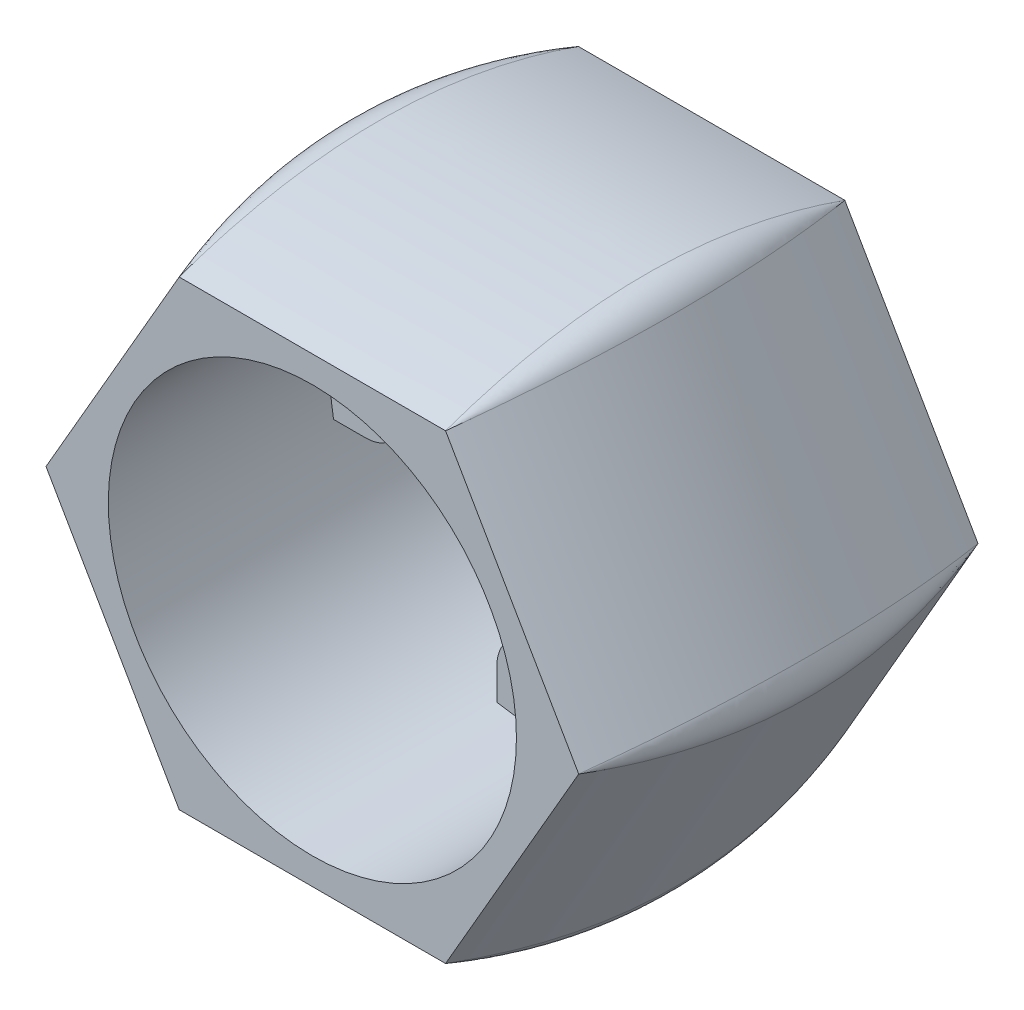
ISO-10303-21;
HEADER;
FILE_DESCRIPTION(('STEP AP214'),'2;1');
FILE_NAME('part.step','',(''),(''),'','','');
FILE_SCHEMA(('AUTOMOTIVE_DESIGN { 1 0 10303 214 1 1 1 1 }'));
ENDSEC;
DATA;
#1=APPLICATION_CONTEXT('core data for automotive mechanical design processes');
#2=APPLICATION_PROTOCOL_DEFINITION('international standard','automotive_design',2000,#1);
#3=PRODUCT_CONTEXT('',#1,'mechanical');
#4=PRODUCT('Part','Part','',(#3));
#5=PRODUCT_RELATED_PRODUCT_CATEGORY('part','',(#4));
#6=PRODUCT_DEFINITION_FORMATION('','',#4);
#7=PRODUCT_DEFINITION_CONTEXT('part definition',#1,'design');
#8=PRODUCT_DEFINITION('design','',#6,#7);
#9=PRODUCT_DEFINITION_SHAPE('','',#8);
#10=(LENGTH_UNIT() NAMED_UNIT(*) SI_UNIT(.MILLI.,.METRE.));
#11=(NAMED_UNIT(*) PLANE_ANGLE_UNIT() SI_UNIT($,.RADIAN.));
#12=(NAMED_UNIT(*) SI_UNIT($,.STERADIAN.) SOLID_ANGLE_UNIT());
#13=UNCERTAINTY_MEASURE_WITH_UNIT(LENGTH_MEASURE(1.E-05),#10,'distance_accuracy_value','');
#14=(GEOMETRIC_REPRESENTATION_CONTEXT(3) GLOBAL_UNCERTAINTY_ASSIGNED_CONTEXT((#13)) GLOBAL_UNIT_ASSIGNED_CONTEXT((#10,
#11,#12)) REPRESENTATION_CONTEXT('',''));
#15=CARTESIAN_POINT('',(0.,0.,0.));
#16=DIRECTION('',(0.,0.,1.));
#17=DIRECTION('',(1.,0.,0.));
#18=AXIS2_PLACEMENT_3D('',#15,#16,#17);
#19=CARTESIAN_POINT('',(0.,0.,45.));
#20=DIRECTION('',(0.,0.,-1.));
#21=DIRECTION('',(-1.,0.,0.));
#22=AXIS2_PLACEMENT_3D('',#19,#20,#21);
#23=CYLINDRICAL_SURFACE('',#22,23.);
#24=DIRECTION('',(0.,0.,-1.));
#25=VECTOR('',#24,1.);
#26=CARTESIAN_POINT('',(22.6132704401641,4.2,20.));
#27=LINE('',#26,#25);
#28=CARTESIAN_POINT('',(22.6132704401641,4.2,20.));
#29=VERTEX_POINT('',#28);
#30=CARTESIAN_POINT('',(22.6132704401641,4.2,0.));
#31=VERTEX_POINT('',#30);
#32=EDGE_CURVE('E401',#29,#31,#27,.T.);
#33=ORIENTED_EDGE('',*,*,#32,.F.);
#34=CARTESIAN_POINT('',(0.,0.,20.));
#35=DIRECTION('',(0.,0.,1.));
#36=DIRECTION('',(1.,0.,0.));
#37=AXIS2_PLACEMENT_3D('',#34,#35,#36);
#38=CIRCLE('',#37,23.);
#39=CARTESIAN_POINT('',(22.6132704401641,-4.2,20.));
#40=VERTEX_POINT('',#39);
#41=EDGE_CURVE('E398',#40,#29,#38,.T.);
#42=ORIENTED_EDGE('',*,*,#41,.F.);
#43=DIRECTION('',(0.,0.,-1.));
#44=VECTOR('',#43,1.);
#45=CARTESIAN_POINT('',(22.6132704401641,-4.2,20.));
#46=LINE('',#45,#44);
#47=CARTESIAN_POINT('',(22.6132704401641,-4.2,0.));
#48=VERTEX_POINT('',#47);
#49=EDGE_CURVE('E419',#40,#48,#46,.T.);
#50=ORIENTED_EDGE('',*,*,#49,.T.);
#51=CARTESIAN_POINT('',(0.,0.,0.));
#52=DIRECTION('',(0.,0.,1.));
#53=DIRECTION('',(1.,0.,0.));
#54=AXIS2_PLACEMENT_3D('',#51,#52,#53);
#55=CIRCLE('',#54,23.);
#56=CARTESIAN_POINT('',(4.2,-22.6132704401641,0.));
#57=VERTEX_POINT('',#56);
#58=EDGE_CURVE('E430',#57,#48,#55,.T.);
#59=ORIENTED_EDGE('',*,*,#58,.F.);
#60=DIRECTION('',(0.,0.,-1.));
#61=VECTOR('',#60,1.);
#62=CARTESIAN_POINT('',(4.2,-22.6132704401641,20.));
#63=LINE('',#62,#61);
#64=CARTESIAN_POINT('',(4.2,-22.6132704401641,20.));
#65=VERTEX_POINT('',#64);
#66=EDGE_CURVE('E450',#65,#57,#63,.T.);
#67=ORIENTED_EDGE('',*,*,#66,.F.);
#68=CARTESIAN_POINT('',(0.,0.,20.));
#69=DIRECTION('',(0.,0.,1.));
#70=DIRECTION('',(1.,0.,0.));
#71=AXIS2_PLACEMENT_3D('',#68,#69,#70);
#72=CIRCLE('',#71,23.);
#73=CARTESIAN_POINT('',(-4.2,-22.6132704401641,20.));
#74=VERTEX_POINT('',#73);
#75=EDGE_CURVE('E447',#74,#65,#72,.T.);
#76=ORIENTED_EDGE('',*,*,#75,.F.);
#77=DIRECTION('',(0.,0.,-1.));
#78=VECTOR('',#77,1.);
#79=CARTESIAN_POINT('',(-4.2,-22.6132704401641,20.));
#80=LINE('',#79,#78);
#81=CARTESIAN_POINT('',(-4.2,-22.6132704401641,0.));
#82=VERTEX_POINT('',#81);
#83=EDGE_CURVE('E466',#74,#82,#80,.T.);
#84=ORIENTED_EDGE('',*,*,#83,.T.);
#85=CARTESIAN_POINT('',(-22.6132704401641,-4.2,0.));
#86=VERTEX_POINT('',#85);
#87=EDGE_CURVE('E616',#86,#82,#55,.T.);
#88=ORIENTED_EDGE('',*,*,#87,.F.);
#89=DIRECTION('',(0.,0.,-1.));
#90=VECTOR('',#89,1.);
#91=CARTESIAN_POINT('',(-22.6132704401641,-4.2,20.));
#92=LINE('',#91,#90);
#93=CARTESIAN_POINT('',(-22.6132704401641,-4.2,20.));
#94=VERTEX_POINT('',#93);
#95=EDGE_CURVE('E495',#94,#86,#92,.T.);
#96=ORIENTED_EDGE('',*,*,#95,.F.);
#97=CARTESIAN_POINT('',(0.,0.,20.));
#98=DIRECTION('',(0.,0.,1.));
#99=DIRECTION('',(1.,0.,0.));
#100=AXIS2_PLACEMENT_3D('',#97,#98,#99);
#101=CIRCLE('',#100,23.);
#102=CARTESIAN_POINT('',(-22.6132704401641,4.2,20.));
#103=VERTEX_POINT('',#102);
#104=EDGE_CURVE('E492',#103,#94,#101,.T.);
#105=ORIENTED_EDGE('',*,*,#104,.F.);
#106=DIRECTION('',(0.,0.,-1.));
#107=VECTOR('',#106,1.);
#108=CARTESIAN_POINT('',(-22.6132704401641,4.2,20.));
#109=LINE('',#108,#107);
#110=CARTESIAN_POINT('',(-22.6132704401641,4.2,0.));
#111=VERTEX_POINT('',#110);
#112=EDGE_CURVE('E511',#103,#111,#109,.T.);
#113=ORIENTED_EDGE('',*,*,#112,.T.);
#114=CARTESIAN_POINT('',(-4.2,22.6132704401641,0.));
#115=VERTEX_POINT('',#114);
#116=EDGE_CURVE('E587',#115,#111,#55,.T.);
#117=ORIENTED_EDGE('',*,*,#116,.F.);
#118=DIRECTION('',(0.,0.,-1.));
#119=VECTOR('',#118,1.);
#120=CARTESIAN_POINT('',(-4.2,22.6132704401641,20.));
#121=LINE('',#120,#119);
#122=CARTESIAN_POINT('',(-4.2,22.6132704401641,20.));
#123=VERTEX_POINT('',#122);
#124=EDGE_CURVE('E540',#123,#115,#121,.T.);
#125=ORIENTED_EDGE('',*,*,#124,.F.);
#126=CARTESIAN_POINT('',(0.,0.,20.));
#127=DIRECTION('',(0.,0.,1.));
#128=DIRECTION('',(1.,0.,0.));
#129=AXIS2_PLACEMENT_3D('',#126,#127,#128);
#130=CIRCLE('',#129,23.);
#131=CARTESIAN_POINT('',(4.2,22.6132704401641,20.));
#132=VERTEX_POINT('',#131);
#133=EDGE_CURVE('E537',#132,#123,#130,.T.);
#134=ORIENTED_EDGE('',*,*,#133,.F.);
#135=DIRECTION('',(0.,0.,-1.));
#136=VECTOR('',#135,1.);
#137=CARTESIAN_POINT('',(4.2,22.6132704401641,20.));
#138=LINE('',#137,#136);
#139=CARTESIAN_POINT('',(4.2,22.6132704401641,0.));
#140=VERTEX_POINT('',#139);
#141=EDGE_CURVE('E556',#132,#140,#138,.T.);
#142=ORIENTED_EDGE('',*,*,#141,.T.);
#143=EDGE_CURVE('E220',#31,#140,#55,.T.);
#144=ORIENTED_EDGE('',*,*,#143,.F.);
#145=EDGE_LOOP('',(#33,#42,#50,#59,#67,#76,#84,#88,#96,#105,#113,#117,#125,#134,#142,#144));
#146=FACE_BOUND('',#145,.T.);
#147=CARTESIAN_POINT('',(0.,0.,45.));
#148=DIRECTION('',(0.,0.,1.));
#149=DIRECTION('',(1.,0.,0.));
#150=AXIS2_PLACEMENT_3D('',#147,#148,#149);
#151=CIRCLE('',#150,23.);
#152=CARTESIAN_POINT('',(23.,0.,45.));
#153=VERTEX_POINT('',#152);
#154=EDGE_CURVE('E566',#153,#153,#151,.T.);
#155=ORIENTED_EDGE('',*,*,#154,.T.);
#156=EDGE_LOOP('',(#155));
#157=FACE_BOUND('',#156,.T.);
#158=ADVANCED_FACE('F51',(#146,#157),#23,.F.);
#159=CARTESIAN_POINT('',(0.,0.,45.));
#160=DIRECTION('',(0.,0.,1.));
#161=DIRECTION('',(1.,0.,0.));
#162=AXIS2_PLACEMENT_3D('',#159,#160,#161);
#163=PLANE('',#162);
#164=ORIENTED_EDGE('',*,*,#154,.F.);
#165=EDGE_LOOP('',(#164));
#166=FACE_BOUND('',#165,.T.);
#167=DIRECTION('',(-1.,0.,0.));
#168=VECTOR('',#167,1.);
#169=CARTESIAN_POINT('',(0.,26.,45.));
#170=LINE('',#169,#168);
#171=CARTESIAN_POINT('',(15.0111069989983,25.999999999882,45.));
#172=VERTEX_POINT('',#171);
#173=CARTESIAN_POINT('',(-15.0111069989303,26.,45.));
#174=VERTEX_POINT('',#173);
#175=EDGE_CURVE('E570',#172,#174,#170,.T.);
#176=ORIENTED_EDGE('',*,*,#175,.T.);
#177=DIRECTION('',(-0.499999999999997,-0.86602540378444,0.));
#178=VECTOR('',#177,1.);
#179=CARTESIAN_POINT('',(-22.5166604983954,12.9999999999999,45.));
#180=LINE('',#179,#178);
#181=CARTESIAN_POINT('',(-30.0222139976753,-1.07046316255577E-10,45.0000000006048));
#182=VERTEX_POINT('',#181);
#183=EDGE_CURVE('E229',#174,#182,#180,.T.);
#184=ORIENTED_EDGE('',*,*,#183,.T.);
#185=DIRECTION('',(0.500000000000003,-0.866025403784437,0.));
#186=VECTOR('',#185,1.);
#187=CARTESIAN_POINT('',(-22.5166604983954,-13.0000000000001,45.));
#188=LINE('',#187,#186);
#189=CARTESIAN_POINT('',(-15.0111069987568,-26.0000000000651,45.0000000000305));
#190=VERTEX_POINT('',#189);
#191=EDGE_CURVE('E575',#182,#190,#188,.T.);
#192=ORIENTED_EDGE('',*,*,#191,.T.);
#193=DIRECTION('',(1.,0.,0.));
#194=VECTOR('',#193,1.);
#195=CARTESIAN_POINT('',(0.,-26.,45.));
#196=LINE('',#195,#194);
#197=CARTESIAN_POINT('',(15.0111069989304,-26.,45.));
#198=VERTEX_POINT('',#197);
#199=EDGE_CURVE('E579',#190,#198,#196,.T.);
#200=ORIENTED_EDGE('',*,*,#199,.T.);
#201=DIRECTION('',(0.499999999999997,0.86602540378444,0.));
#202=VECTOR('',#201,1.);
#203=CARTESIAN_POINT('',(22.5166604983954,-12.9999999999999,45.));
#204=LINE('',#203,#202);
#205=CARTESIAN_POINT('',(30.0222139976435,6.26686202931381E-11,45.0000000006034));
#206=VERTEX_POINT('',#205);
#207=EDGE_CURVE('E60',#198,#206,#204,.T.);
#208=ORIENTED_EDGE('',*,*,#207,.T.);
#209=DIRECTION('',(-0.500000000000003,0.866025403784437,0.));
#210=VECTOR('',#209,1.);
#211=CARTESIAN_POINT('',(22.5166604983954,13.0000000000001,45.));
#212=LINE('',#211,#210);
#213=EDGE_CURVE('E11',#206,#172,#212,.T.);
#214=ORIENTED_EDGE('',*,*,#213,.T.);
#215=EDGE_LOOP('',(#176,#184,#192,#200,#208,#214));
#216=FACE_BOUND('',#215,.T.);
#217=ADVANCED_FACE('F605',(#166,#216),#163,.T.);
#218=CARTESIAN_POINT('',(0.,0.,0.));
#219=DIRECTION('',(0.,0.,1.));
#220=DIRECTION('',(1.,0.,0.));
#221=AXIS2_PLACEMENT_3D('',#218,#219,#220);
#222=PLANE('',#221);
#223=ORIENTED_EDGE('',*,*,#143,.T.);
#224=DIRECTION('',(0.,1.,0.));
#225=VECTOR('',#224,1.);
#226=CARTESIAN_POINT('',(4.2,0.,0.));
#227=LINE('',#226,#225);
#228=CARTESIAN_POINT('',(4.2,19.,0.));
#229=VERTEX_POINT('',#228);
#230=EDGE_CURVE('E526',#229,#140,#227,.T.);
#231=ORIENTED_EDGE('',*,*,#230,.F.);
#232=CARTESIAN_POINT('',(0.,19.,0.));
#233=DIRECTION('',(0.,0.,1.));
#234=DIRECTION('',(1.,0.,0.));
#235=AXIS2_PLACEMENT_3D('',#232,#233,#234);
#236=CIRCLE('',#235,4.2);
#237=CARTESIAN_POINT('',(-4.2,19.,0.));
#238=VERTEX_POINT('',#237);
#239=EDGE_CURVE('E547',#238,#229,#236,.T.);
#240=ORIENTED_EDGE('',*,*,#239,.F.);
#241=DIRECTION('',(0.,1.,0.));
#242=VECTOR('',#241,1.);
#243=CARTESIAN_POINT('',(-4.2,0.,0.));
#244=LINE('',#243,#242);
#245=EDGE_CURVE('E544',#238,#115,#244,.T.);
#246=ORIENTED_EDGE('',*,*,#245,.T.);
#247=ORIENTED_EDGE('',*,*,#116,.T.);
#248=DIRECTION('',(-1.,0.,0.));
#249=VECTOR('',#248,1.);
#250=CARTESIAN_POINT('',(0.,4.19999999999998,0.));
#251=LINE('',#250,#249);
#252=CARTESIAN_POINT('',(-19.,4.2,0.));
#253=VERTEX_POINT('',#252);
#254=EDGE_CURVE('E481',#253,#111,#251,.T.);
#255=ORIENTED_EDGE('',*,*,#254,.F.);
#256=CARTESIAN_POINT('',(-19.,0.,0.));
#257=DIRECTION('',(0.,0.,1.));
#258=DIRECTION('',(1.,0.,0.));
#259=AXIS2_PLACEMENT_3D('',#256,#257,#258);
#260=CIRCLE('',#259,4.2);
#261=CARTESIAN_POINT('',(-19.,-4.2,0.));
#262=VERTEX_POINT('',#261);
#263=EDGE_CURVE('E503',#262,#253,#260,.T.);
#264=ORIENTED_EDGE('',*,*,#263,.F.);
#265=DIRECTION('',(-1.,0.,0.));
#266=VECTOR('',#265,1.);
#267=CARTESIAN_POINT('',(0.,-4.20000000000002,0.));
#268=LINE('',#267,#266);
#269=EDGE_CURVE('E75',#262,#86,#268,.T.);
#270=ORIENTED_EDGE('',*,*,#269,.T.);
#271=ORIENTED_EDGE('',*,*,#87,.T.);
#272=DIRECTION('',(0.,-1.,0.));
#273=VECTOR('',#272,1.);
#274=CARTESIAN_POINT('',(-4.2,0.,0.));
#275=LINE('',#274,#273);
#276=CARTESIAN_POINT('',(-4.2,-19.,0.));
#277=VERTEX_POINT('',#276);
#278=EDGE_CURVE('E436',#277,#82,#275,.T.);
#279=ORIENTED_EDGE('',*,*,#278,.F.);
#280=CARTESIAN_POINT('',(0.,-19.,0.));
#281=DIRECTION('',(0.,0.,1.));
#282=DIRECTION('',(1.,0.,0.));
#283=AXIS2_PLACEMENT_3D('',#280,#281,#282);
#284=CIRCLE('',#283,4.2);
#285=CARTESIAN_POINT('',(4.2,-19.,0.));
#286=VERTEX_POINT('',#285);
#287=EDGE_CURVE('E458',#286,#277,#284,.T.);
#288=ORIENTED_EDGE('',*,*,#287,.F.);
#289=DIRECTION('',(0.,-1.,0.));
#290=VECTOR('',#289,1.);
#291=CARTESIAN_POINT('',(4.20000000000001,0.,0.));
#292=LINE('',#291,#290);
#293=EDGE_CURVE('E68',#286,#57,#292,.T.);
#294=ORIENTED_EDGE('',*,*,#293,.T.);
#295=ORIENTED_EDGE('',*,*,#58,.T.);
#296=DIRECTION('',(1.,0.,0.));
#297=VECTOR('',#296,1.);
#298=CARTESIAN_POINT('',(0.,-4.2,0.));
#299=LINE('',#298,#297);
#300=CARTESIAN_POINT('',(19.,-4.2,0.));
#301=VERTEX_POINT('',#300);
#302=EDGE_CURVE('E387',#301,#48,#299,.T.);
#303=ORIENTED_EDGE('',*,*,#302,.F.);
#304=CARTESIAN_POINT('',(19.,0.,0.));
#305=DIRECTION('',(0.,0.,1.));
#306=DIRECTION('',(1.,0.,0.));
#307=AXIS2_PLACEMENT_3D('',#304,#305,#306);
#308=CIRCLE('',#307,4.2);
#309=CARTESIAN_POINT('',(19.,4.2,0.));
#310=VERTEX_POINT('',#309);
#311=EDGE_CURVE('E410',#310,#301,#308,.T.);
#312=ORIENTED_EDGE('',*,*,#311,.F.);
#313=DIRECTION('',(1.,0.,0.));
#314=VECTOR('',#313,1.);
#315=CARTESIAN_POINT('',(0.,4.19999999999999,0.));
#316=LINE('',#315,#314);
#317=EDGE_CURVE('E406',#310,#31,#316,.T.);
#318=ORIENTED_EDGE('',*,*,#317,.T.);
#319=EDGE_LOOP('',(#223,#231,#240,#246,#247,#255,#264,#270,#271,#279,#288,#294,#295,#303,#312,#318));
#320=FACE_BOUND('',#319,.T.);
#321=DIRECTION('',(-1.,0.,0.));
#322=VECTOR('',#321,1.);
#323=CARTESIAN_POINT('',(0.,26.,0.));
#324=LINE('',#323,#322);
#325=CARTESIAN_POINT('',(15.0111069989931,26.0000000000001,0.));
#326=VERTEX_POINT('',#325);
#327=CARTESIAN_POINT('',(-15.0111069989645,26.,-1.59124867323539E-10));
#328=VERTEX_POINT('',#327);
#329=EDGE_CURVE('E206',#326,#328,#324,.T.);
#330=ORIENTED_EDGE('',*,*,#329,.F.);
#331=DIRECTION('',(-0.500000000000003,0.866025403784437,0.));
#332=VECTOR('',#331,1.);
#333=CARTESIAN_POINT('',(22.5166604983954,13.0000000000001,0.));
#334=LINE('',#333,#332);
#335=CARTESIAN_POINT('',(30.0222139976915,2.92899385301427E-10,-9.23328376386431E-11));
#336=VERTEX_POINT('',#335);
#337=EDGE_CURVE('E54',#336,#326,#334,.T.);
#338=ORIENTED_EDGE('',*,*,#337,.F.);
#339=DIRECTION('',(0.499999999999997,0.86602540378444,0.));
#340=VECTOR('',#339,1.);
#341=CARTESIAN_POINT('',(22.5166604983954,-12.9999999999999,0.));
#342=LINE('',#341,#340);
#343=CARTESIAN_POINT('',(15.0111069992849,-25.9999999999521,-4.52970994047064E-11));
#344=VERTEX_POINT('',#343);
#345=EDGE_CURVE('E594',#344,#336,#342,.T.);
#346=ORIENTED_EDGE('',*,*,#345,.F.);
#347=DIRECTION('',(1.,0.,0.));
#348=VECTOR('',#347,1.);
#349=CARTESIAN_POINT('',(0.,-26.,0.));
#350=LINE('',#349,#348);
#351=CARTESIAN_POINT('',(-15.0111069987067,-26.0000000001087,-2.04281036531029E-11));
#352=VERTEX_POINT('',#351);
#353=EDGE_CURVE('E591',#352,#344,#350,.T.);
#354=ORIENTED_EDGE('',*,*,#353,.F.);
#355=DIRECTION('',(0.500000000000003,-0.866025403784437,0.));
#356=VECTOR('',#355,1.);
#357=CARTESIAN_POINT('',(-22.5166604983954,-13.0000000000001,0.));
#358=LINE('',#357,#356);
#359=CARTESIAN_POINT('',(-30.0222139975279,-1.20979615214623E-11,-5.64071966251785E-10));
#360=VERTEX_POINT('',#359);
#361=EDGE_CURVE('E238',#360,#352,#358,.T.);
#362=ORIENTED_EDGE('',*,*,#361,.F.);
#363=DIRECTION('',(-0.499999999999997,-0.86602540378444,0.));
#364=VECTOR('',#363,1.);
#365=CARTESIAN_POINT('',(-22.5166604983954,12.9999999999999,0.));
#366=LINE('',#365,#364);
#367=EDGE_CURVE('E219',#328,#360,#366,.T.);
#368=ORIENTED_EDGE('',*,*,#367,.F.);
#369=EDGE_LOOP('',(#330,#338,#346,#354,#362,#368));
#370=FACE_BOUND('',#369,.T.);
#371=CARTESIAN_POINT('',(0.,19.,0.));
#372=DIRECTION('',(0.,0.,1.));
#373=DIRECTION('',(1.,0.,0.));
#374=AXIS2_PLACEMENT_3D('',#371,#372,#373);
#375=CIRCLE('',#374,1.7);
#376=CARTESIAN_POINT('',(1.7,19.,0.));
#377=VERTEX_POINT('',#376);
#378=EDGE_CURVE('E372',#377,#377,#375,.T.);
#379=ORIENTED_EDGE('',*,*,#378,.T.);
#380=EDGE_LOOP('',(#379));
#381=FACE_BOUND('',#380,.T.);
#382=CARTESIAN_POINT('',(-19.,0.,0.));
#383=DIRECTION('',(0.,0.,1.));
#384=DIRECTION('',(1.,0.,0.));
#385=AXIS2_PLACEMENT_3D('',#382,#383,#384);
#386=CIRCLE('',#385,1.7);
#387=CARTESIAN_POINT('',(-17.3,0.,0.));
#388=VERTEX_POINT('',#387);
#389=EDGE_CURVE('E496',#388,#388,#386,.T.);
#390=ORIENTED_EDGE('',*,*,#389,.T.);
#391=EDGE_LOOP('',(#390));
#392=FACE_BOUND('',#391,.T.);
#393=CARTESIAN_POINT('',(0.,-19.,0.));
#394=DIRECTION('',(0.,0.,1.));
#395=DIRECTION('',(1.,0.,0.));
#396=AXIS2_PLACEMENT_3D('',#393,#394,#395);
#397=CIRCLE('',#396,1.7);
#398=CARTESIAN_POINT('',(1.7,-19.,0.));
#399=VERTEX_POINT('',#398);
#400=EDGE_CURVE('E451',#399,#399,#397,.T.);
#401=ORIENTED_EDGE('',*,*,#400,.T.);
#402=EDGE_LOOP('',(#401));
#403=FACE_BOUND('',#402,.T.);
#404=CARTESIAN_POINT('',(19.,0.,0.));
#405=DIRECTION('',(0.,0.,1.));
#406=DIRECTION('',(1.,0.,0.));
#407=AXIS2_PLACEMENT_3D('',#404,#405,#406);
#408=CIRCLE('',#407,1.7);
#409=CARTESIAN_POINT('',(20.7,0.,0.));
#410=VERTEX_POINT('',#409);
#411=EDGE_CURVE('E402',#410,#410,#408,.T.);
#412=ORIENTED_EDGE('',*,*,#411,.T.);
#413=EDGE_LOOP('',(#412));
#414=FACE_BOUND('',#413,.T.);
#415=ADVANCED_FACE('F235',(#320,#370,#381,#392,#403,#414),#222,.F.);
#416=CARTESIAN_POINT('',(-4.2,0.,20.));
#417=DIRECTION('',(-1.,0.,0.));
#418=DIRECTION('',(0.,-1.,0.));
#419=AXIS2_PLACEMENT_3D('',#416,#417,#418);
#420=PLANE('',#419);
#421=ORIENTED_EDGE('',*,*,#245,.F.);
#422=DIRECTION('',(0.,0.,-1.));
#423=VECTOR('',#422,1.);
#424=CARTESIAN_POINT('',(-4.2,19.,20.));
#425=LINE('',#424,#423);
#426=CARTESIAN_POINT('',(-4.2,19.,20.));
#427=VERTEX_POINT('',#426);
#428=EDGE_CURVE('E500',#427,#238,#425,.T.);
#429=ORIENTED_EDGE('',*,*,#428,.F.);
#430=DIRECTION('',(0.,1.,0.));
#431=VECTOR('',#430,1.);
#432=CARTESIAN_POINT('',(-4.2,0.,20.));
#433=LINE('',#432,#431);
#434=EDGE_CURVE('E525',#427,#123,#433,.T.);
#435=ORIENTED_EDGE('',*,*,#434,.T.);
#436=ORIENTED_EDGE('',*,*,#124,.T.);
#437=EDGE_LOOP('',(#421,#429,#435,#436));
#438=FACE_BOUND('',#437,.T.);
#439=ADVANCED_FACE('F675',(#438),#420,.T.);
#440=CARTESIAN_POINT('',(0.,19.,20.));
#441=DIRECTION('',(0.,0.,-1.));
#442=DIRECTION('',(-1.,0.,0.));
#443=AXIS2_PLACEMENT_3D('',#440,#441,#442);
#444=CYLINDRICAL_SURFACE('',#443,4.2);
#445=ORIENTED_EDGE('',*,*,#239,.T.);
#446=DIRECTION('',(0.,0.,-1.));
#447=VECTOR('',#446,1.);
#448=CARTESIAN_POINT('',(4.2,19.,20.));
#449=LINE('',#448,#447);
#450=CARTESIAN_POINT('',(4.2,19.,20.));
#451=VERTEX_POINT('',#450);
#452=EDGE_CURVE('E560',#451,#229,#449,.T.);
#453=ORIENTED_EDGE('',*,*,#452,.F.);
#454=CARTESIAN_POINT('',(0.,19.,20.));
#455=DIRECTION('',(0.,0.,1.));
#456=DIRECTION('',(1.,0.,0.));
#457=AXIS2_PLACEMENT_3D('',#454,#455,#456);
#458=CIRCLE('',#457,4.2);
#459=EDGE_CURVE('E530',#427,#451,#458,.T.);
#460=ORIENTED_EDGE('',*,*,#459,.F.);
#461=ORIENTED_EDGE('',*,*,#428,.T.);
#462=EDGE_LOOP('',(#445,#453,#460,#461));
#463=FACE_BOUND('',#462,.T.);
#464=ADVANCED_FACE('F673',(#463),#444,.T.);
#465=CARTESIAN_POINT('',(4.2,0.,20.));
#466=DIRECTION('',(-1.,0.,0.));
#467=DIRECTION('',(0.,-1.,0.));
#468=AXIS2_PLACEMENT_3D('',#465,#466,#467);
#469=PLANE('',#468);
#470=ORIENTED_EDGE('',*,*,#230,.T.);
#471=ORIENTED_EDGE('',*,*,#141,.F.);
#472=DIRECTION('',(0.,1.,0.));
#473=VECTOR('',#472,1.);
#474=CARTESIAN_POINT('',(4.2,0.,20.));
#475=LINE('',#474,#473);
#476=EDGE_CURVE('E534',#451,#132,#475,.T.);
#477=ORIENTED_EDGE('',*,*,#476,.F.);
#478=ORIENTED_EDGE('',*,*,#452,.T.);
#479=EDGE_LOOP('',(#470,#471,#477,#478));
#480=FACE_BOUND('',#479,.T.);
#481=ADVANCED_FACE('F669',(#480),#469,.F.);
#482=CARTESIAN_POINT('',(0.,19.,20.));
#483=DIRECTION('',(0.,0.,-1.));
#484=DIRECTION('',(-1.,0.,0.));
#485=AXIS2_PLACEMENT_3D('',#482,#483,#484);
#486=CYLINDRICAL_SURFACE('',#485,1.7);
#487=CARTESIAN_POINT('',(0.,19.,20.));
#488=DIRECTION('',(0.,0.,1.));
#489=DIRECTION('',(1.,0.,0.));
#490=AXIS2_PLACEMENT_3D('',#487,#488,#489);
#491=CIRCLE('',#490,1.7);
#492=CARTESIAN_POINT('',(1.7,19.,20.));
#493=VERTEX_POINT('',#492);
#494=EDGE_CURVE('E521',#493,#493,#491,.T.);
#495=ORIENTED_EDGE('',*,*,#494,.T.);
#496=EDGE_LOOP('',(#495));
#497=FACE_BOUND('',#496,.T.);
#498=ORIENTED_EDGE('',*,*,#378,.F.);
#499=EDGE_LOOP('',(#498));
#500=FACE_BOUND('',#499,.T.);
#501=ADVANCED_FACE('F680',(#497,#500),#486,.F.);
#502=CARTESIAN_POINT('',(0.,0.,20.));
#503=DIRECTION('',(0.,0.,1.));
#504=DIRECTION('',(1.,0.,0.));
#505=AXIS2_PLACEMENT_3D('',#502,#503,#504);
#506=PLANE('',#505);
#507=ORIENTED_EDGE('',*,*,#494,.F.);
#508=EDGE_LOOP('',(#507));
#509=FACE_BOUND('',#508,.T.);
#510=ORIENTED_EDGE('',*,*,#434,.F.);
#511=ORIENTED_EDGE('',*,*,#459,.T.);
#512=ORIENTED_EDGE('',*,*,#476,.T.);
#513=ORIENTED_EDGE('',*,*,#133,.T.);
#514=EDGE_LOOP('',(#510,#511,#512,#513));
#515=FACE_BOUND('',#514,.T.);
#516=ADVANCED_FACE('F678',(#509,#515),#506,.T.);
#517=CARTESIAN_POINT('',(0.,-4.20000000000002,20.));
#518=DIRECTION('',(0.,-1.,0.));
#519=DIRECTION('',(1.,0.,0.));
#520=AXIS2_PLACEMENT_3D('',#517,#518,#519);
#521=PLANE('',#520);
#522=ORIENTED_EDGE('',*,*,#269,.F.);
#523=DIRECTION('',(0.,0.,-1.));
#524=VECTOR('',#523,1.);
#525=CARTESIAN_POINT('',(-19.,-4.2,20.));
#526=LINE('',#525,#524);
#527=CARTESIAN_POINT('',(-19.,-4.2,20.));
#528=VERTEX_POINT('',#527);
#529=EDGE_CURVE('E455',#528,#262,#526,.T.);
#530=ORIENTED_EDGE('',*,*,#529,.F.);
#531=DIRECTION('',(-1.,0.,0.));
#532=VECTOR('',#531,1.);
#533=CARTESIAN_POINT('',(0.,-4.20000000000002,20.));
#534=LINE('',#533,#532);
#535=EDGE_CURVE('E480',#528,#94,#534,.T.);
#536=ORIENTED_EDGE('',*,*,#535,.T.);
#537=ORIENTED_EDGE('',*,*,#95,.T.);
#538=EDGE_LOOP('',(#522,#530,#536,#537));
#539=FACE_BOUND('',#538,.T.);
#540=ADVANCED_FACE('F637',(#539),#521,.T.);
#541=CARTESIAN_POINT('',(-19.,0.,20.));
#542=DIRECTION('',(0.,0.,-1.));
#543=DIRECTION('',(-1.,0.,0.));
#544=AXIS2_PLACEMENT_3D('',#541,#542,#543);
#545=CYLINDRICAL_SURFACE('',#544,4.2);
#546=ORIENTED_EDGE('',*,*,#263,.T.);
#547=DIRECTION('',(0.,0.,-1.));
#548=VECTOR('',#547,1.);
#549=CARTESIAN_POINT('',(-19.,4.2,20.));
#550=LINE('',#549,#548);
#551=CARTESIAN_POINT('',(-19.,4.2,20.));
#552=VERTEX_POINT('',#551);
#553=EDGE_CURVE('E515',#552,#253,#550,.T.);
#554=ORIENTED_EDGE('',*,*,#553,.F.);
#555=CARTESIAN_POINT('',(-19.,0.,20.));
#556=DIRECTION('',(0.,0.,1.));
#557=DIRECTION('',(1.,0.,0.));
#558=AXIS2_PLACEMENT_3D('',#555,#556,#557);
#559=CIRCLE('',#558,4.2);
#560=EDGE_CURVE('E485',#528,#552,#559,.T.);
#561=ORIENTED_EDGE('',*,*,#560,.F.);
#562=ORIENTED_EDGE('',*,*,#529,.T.);
#563=EDGE_LOOP('',(#546,#554,#561,#562));
#564=FACE_BOUND('',#563,.T.);
#565=ADVANCED_FACE('F635',(#564),#545,.T.);
#566=CARTESIAN_POINT('',(0.,4.19999999999998,20.));
#567=DIRECTION('',(0.,-1.,0.));
#568=DIRECTION('',(1.,0.,0.));
#569=AXIS2_PLACEMENT_3D('',#566,#567,#568);
#570=PLANE('',#569);
#571=ORIENTED_EDGE('',*,*,#254,.T.);
#572=ORIENTED_EDGE('',*,*,#112,.F.);
#573=DIRECTION('',(-1.,0.,0.));
#574=VECTOR('',#573,1.);
#575=CARTESIAN_POINT('',(0.,4.19999999999998,20.));
#576=LINE('',#575,#574);
#577=EDGE_CURVE('E489',#552,#103,#576,.T.);
#578=ORIENTED_EDGE('',*,*,#577,.F.);
#579=ORIENTED_EDGE('',*,*,#553,.T.);
#580=EDGE_LOOP('',(#571,#572,#578,#579));
#581=FACE_BOUND('',#580,.T.);
#582=ADVANCED_FACE('F631',(#581),#570,.F.);
#583=CARTESIAN_POINT('',(-19.,0.,20.));
#584=DIRECTION('',(0.,0.,-1.));
#585=DIRECTION('',(-1.,0.,0.));
#586=AXIS2_PLACEMENT_3D('',#583,#584,#585);
#587=CYLINDRICAL_SURFACE('',#586,1.7);
#588=CARTESIAN_POINT('',(-19.,0.,20.));
#589=DIRECTION('',(0.,0.,1.));
#590=DIRECTION('',(1.,0.,0.));
#591=AXIS2_PLACEMENT_3D('',#588,#589,#590);
#592=CIRCLE('',#591,1.7);
#593=CARTESIAN_POINT('',(-17.3,0.,20.));
#594=VERTEX_POINT('',#593);
#595=EDGE_CURVE('E476',#594,#594,#592,.T.);
#596=ORIENTED_EDGE('',*,*,#595,.T.);
#597=EDGE_LOOP('',(#596));
#598=FACE_BOUND('',#597,.T.);
#599=ORIENTED_EDGE('',*,*,#389,.F.);
#600=EDGE_LOOP('',(#599));
#601=FACE_BOUND('',#600,.T.);
#602=ADVANCED_FACE('F745',(#598,#601),#587,.F.);
#603=CARTESIAN_POINT('',(0.,0.,20.));
#604=DIRECTION('',(0.,0.,1.));
#605=DIRECTION('',(1.,0.,0.));
#606=AXIS2_PLACEMENT_3D('',#603,#604,#605);
#607=PLANE('',#606);
#608=ORIENTED_EDGE('',*,*,#595,.F.);
#609=EDGE_LOOP('',(#608));
#610=FACE_BOUND('',#609,.T.);
#611=ORIENTED_EDGE('',*,*,#535,.F.);
#612=ORIENTED_EDGE('',*,*,#560,.T.);
#613=ORIENTED_EDGE('',*,*,#577,.T.);
#614=ORIENTED_EDGE('',*,*,#104,.T.);
#615=EDGE_LOOP('',(#611,#612,#613,#614));
#616=FACE_BOUND('',#615,.T.);
#617=ADVANCED_FACE('F754',(#610,#616),#607,.T.);
#618=CARTESIAN_POINT('',(4.20000000000001,0.,20.));
#619=DIRECTION('',(1.,0.,0.));
#620=DIRECTION('',(0.,1.,0.));
#621=AXIS2_PLACEMENT_3D('',#618,#619,#620);
#622=PLANE('',#621);
#623=ORIENTED_EDGE('',*,*,#293,.F.);
#624=DIRECTION('',(0.,0.,-1.));
#625=VECTOR('',#624,1.);
#626=CARTESIAN_POINT('',(4.2,-19.,20.));
#627=LINE('',#626,#625);
#628=CARTESIAN_POINT('',(4.2,-19.,20.));
#629=VERTEX_POINT('',#628);
#630=EDGE_CURVE('E407',#629,#286,#627,.T.);
#631=ORIENTED_EDGE('',*,*,#630,.F.);
#632=DIRECTION('',(0.,-1.,0.));
#633=VECTOR('',#632,1.);
#634=CARTESIAN_POINT('',(4.20000000000001,0.,20.));
#635=LINE('',#634,#633);
#636=EDGE_CURVE('E435',#629,#65,#635,.T.);
#637=ORIENTED_EDGE('',*,*,#636,.T.);
#638=ORIENTED_EDGE('',*,*,#66,.T.);
#639=EDGE_LOOP('',(#623,#631,#637,#638));
#640=FACE_BOUND('',#639,.T.);
#641=ADVANCED_FACE('F650',(#640),#622,.T.);
#642=CARTESIAN_POINT('',(0.,-19.,20.));
#643=DIRECTION('',(0.,0.,-1.));
#644=DIRECTION('',(-1.,0.,0.));
#645=AXIS2_PLACEMENT_3D('',#642,#643,#644);
#646=CYLINDRICAL_SURFACE('',#645,4.2);
#647=ORIENTED_EDGE('',*,*,#287,.T.);
#648=DIRECTION('',(0.,0.,-1.));
#649=VECTOR('',#648,1.);
#650=CARTESIAN_POINT('',(-4.2,-19.,20.));
#651=LINE('',#650,#649);
#652=CARTESIAN_POINT('',(-4.2,-19.,20.));
#653=VERTEX_POINT('',#652);
#654=EDGE_CURVE('E470',#653,#277,#651,.T.);
#655=ORIENTED_EDGE('',*,*,#654,.F.);
#656=CARTESIAN_POINT('',(0.,-19.,20.));
#657=DIRECTION('',(0.,0.,1.));
#658=DIRECTION('',(1.,0.,0.));
#659=AXIS2_PLACEMENT_3D('',#656,#657,#658);
#660=CIRCLE('',#659,4.2);
#661=EDGE_CURVE('E440',#629,#653,#660,.T.);
#662=ORIENTED_EDGE('',*,*,#661,.F.);
#663=ORIENTED_EDGE('',*,*,#630,.T.);
#664=EDGE_LOOP('',(#647,#655,#662,#663));
#665=FACE_BOUND('',#664,.T.);
#666=ADVANCED_FACE('F647',(#665),#646,.T.);
#667=CARTESIAN_POINT('',(-4.2,0.,20.));
#668=DIRECTION('',(1.,0.,0.));
#669=DIRECTION('',(0.,0.,-1.));
#670=AXIS2_PLACEMENT_3D('',#667,#668,#669);
#671=PLANE('',#670);
#672=ORIENTED_EDGE('',*,*,#278,.T.);
#673=ORIENTED_EDGE('',*,*,#83,.F.);
#674=DIRECTION('',(0.,-1.,0.));
#675=VECTOR('',#674,1.);
#676=CARTESIAN_POINT('',(-4.2,0.,20.));
#677=LINE('',#676,#675);
#678=EDGE_CURVE('E444',#653,#74,#677,.T.);
#679=ORIENTED_EDGE('',*,*,#678,.F.);
#680=ORIENTED_EDGE('',*,*,#654,.T.);
#681=EDGE_LOOP('',(#672,#673,#679,#680));
#682=FACE_BOUND('',#681,.T.);
#683=ADVANCED_FACE('F644',(#682),#671,.F.);
#684=CARTESIAN_POINT('',(0.,-19.,20.));
#685=DIRECTION('',(0.,0.,-1.));
#686=DIRECTION('',(-1.,0.,0.));
#687=AXIS2_PLACEMENT_3D('',#684,#685,#686);
#688=CYLINDRICAL_SURFACE('',#687,1.7);
#689=CARTESIAN_POINT('',(0.,-19.,20.));
#690=DIRECTION('',(0.,0.,1.));
#691=DIRECTION('',(1.,0.,0.));
#692=AXIS2_PLACEMENT_3D('',#689,#690,#691);
#693=CIRCLE('',#692,1.7);
#694=CARTESIAN_POINT('',(1.7,-19.,20.));
#695=VERTEX_POINT('',#694);
#696=EDGE_CURVE('E431',#695,#695,#693,.T.);
#697=ORIENTED_EDGE('',*,*,#696,.T.);
#698=EDGE_LOOP('',(#697));
#699=FACE_BOUND('',#698,.T.);
#700=ORIENTED_EDGE('',*,*,#400,.F.);
#701=EDGE_LOOP('',(#700));
#702=FACE_BOUND('',#701,.T.);
#703=ADVANCED_FACE('F788',(#699,#702),#688,.F.);
#704=CARTESIAN_POINT('',(0.,0.,20.));
#705=DIRECTION('',(0.,0.,1.));
#706=DIRECTION('',(1.,0.,0.));
#707=AXIS2_PLACEMENT_3D('',#704,#705,#706);
#708=PLANE('',#707);
#709=ORIENTED_EDGE('',*,*,#696,.F.);
#710=EDGE_LOOP('',(#709));
#711=FACE_BOUND('',#710,.T.);
#712=ORIENTED_EDGE('',*,*,#636,.F.);
#713=ORIENTED_EDGE('',*,*,#661,.T.);
#714=ORIENTED_EDGE('',*,*,#678,.T.);
#715=ORIENTED_EDGE('',*,*,#75,.T.);
#716=EDGE_LOOP('',(#712,#713,#714,#715));
#717=FACE_BOUND('',#716,.T.);
#718=ADVANCED_FACE('F797',(#711,#717),#708,.T.);
#719=CARTESIAN_POINT('',(0.,4.19999999999999,20.));
#720=DIRECTION('',(0.,1.,0.));
#721=DIRECTION('',(-1.,0.,0.));
#722=AXIS2_PLACEMENT_3D('',#719,#720,#721);
#723=PLANE('',#722);
#724=ORIENTED_EDGE('',*,*,#317,.F.);
#725=DIRECTION('',(0.,0.,-1.));
#726=VECTOR('',#725,1.);
#727=CARTESIAN_POINT('',(19.,4.2,20.));
#728=LINE('',#727,#726);
#729=CARTESIAN_POINT('',(19.,4.2,20.));
#730=VERTEX_POINT('',#729);
#731=EDGE_CURVE('E427',#730,#310,#728,.T.);
#732=ORIENTED_EDGE('',*,*,#731,.F.);
#733=DIRECTION('',(1.,0.,0.));
#734=VECTOR('',#733,1.);
#735=CARTESIAN_POINT('',(0.,4.19999999999999,20.));
#736=LINE('',#735,#734);
#737=EDGE_CURVE('E386',#730,#29,#736,.T.);
#738=ORIENTED_EDGE('',*,*,#737,.T.);
#739=ORIENTED_EDGE('',*,*,#32,.T.);
#740=EDGE_LOOP('',(#724,#732,#738,#739));
#741=FACE_BOUND('',#740,.T.);
#742=ADVANCED_FACE('F665',(#741),#723,.T.);
#743=CARTESIAN_POINT('',(19.,0.,20.));
#744=DIRECTION('',(0.,0.,-1.));
#745=DIRECTION('',(-1.,0.,0.));
#746=AXIS2_PLACEMENT_3D('',#743,#744,#745);
#747=CYLINDRICAL_SURFACE('',#746,4.2);
#748=ORIENTED_EDGE('',*,*,#311,.T.);
#749=DIRECTION('',(0.,0.,-1.));
#750=VECTOR('',#749,1.);
#751=CARTESIAN_POINT('',(19.,-4.2,20.));
#752=LINE('',#751,#750);
#753=CARTESIAN_POINT('',(19.,-4.2,20.));
#754=VERTEX_POINT('',#753);
#755=EDGE_CURVE('E423',#754,#301,#752,.T.);
#756=ORIENTED_EDGE('',*,*,#755,.F.);
#757=CARTESIAN_POINT('',(19.,0.,20.));
#758=DIRECTION('',(0.,0.,1.));
#759=DIRECTION('',(1.,0.,0.));
#760=AXIS2_PLACEMENT_3D('',#757,#758,#759);
#761=CIRCLE('',#760,4.2);
#762=EDGE_CURVE('E391',#730,#754,#761,.T.);
#763=ORIENTED_EDGE('',*,*,#762,.F.);
#764=ORIENTED_EDGE('',*,*,#731,.T.);
#765=EDGE_LOOP('',(#748,#756,#763,#764));
#766=FACE_BOUND('',#765,.T.);
#767=ADVANCED_FACE('F662',(#766),#747,.T.);
#768=CARTESIAN_POINT('',(0.,-4.2,20.));
#769=DIRECTION('',(0.,1.,0.));
#770=DIRECTION('',(-1.,0.,0.));
#771=AXIS2_PLACEMENT_3D('',#768,#769,#770);
#772=PLANE('',#771);
#773=ORIENTED_EDGE('',*,*,#302,.T.);
#774=ORIENTED_EDGE('',*,*,#49,.F.);
#775=DIRECTION('',(1.,0.,0.));
#776=VECTOR('',#775,1.);
#777=CARTESIAN_POINT('',(0.,-4.2,20.));
#778=LINE('',#777,#776);
#779=EDGE_CURVE('E395',#754,#40,#778,.T.);
#780=ORIENTED_EDGE('',*,*,#779,.F.);
#781=ORIENTED_EDGE('',*,*,#755,.T.);
#782=EDGE_LOOP('',(#773,#774,#780,#781));
#783=FACE_BOUND('',#782,.T.);
#784=ADVANCED_FACE('F659',(#783),#772,.F.);
#785=CARTESIAN_POINT('',(19.,0.,20.));
#786=DIRECTION('',(0.,0.,-1.));
#787=DIRECTION('',(-1.,0.,0.));
#788=AXIS2_PLACEMENT_3D('',#785,#786,#787);
#789=CYLINDRICAL_SURFACE('',#788,1.7);
#790=CARTESIAN_POINT('',(19.,0.,20.));
#791=DIRECTION('',(0.,0.,1.));
#792=DIRECTION('',(1.,0.,0.));
#793=AXIS2_PLACEMENT_3D('',#790,#791,#792);
#794=CIRCLE('',#793,1.7);
#795=CARTESIAN_POINT('',(20.7,0.,20.));
#796=VERTEX_POINT('',#795);
#797=EDGE_CURVE('E379',#796,#796,#794,.T.);
#798=ORIENTED_EDGE('',*,*,#797,.T.);
#799=EDGE_LOOP('',(#798));
#800=FACE_BOUND('',#799,.T.);
#801=ORIENTED_EDGE('',*,*,#411,.F.);
#802=EDGE_LOOP('',(#801));
#803=FACE_BOUND('',#802,.T.);
#804=ADVANCED_FACE('F832',(#800,#803),#789,.F.);
#805=CARTESIAN_POINT('',(0.,0.,20.));
#806=DIRECTION('',(0.,0.,1.));
#807=DIRECTION('',(1.,0.,0.));
#808=AXIS2_PLACEMENT_3D('',#805,#806,#807);
#809=PLANE('',#808);
#810=ORIENTED_EDGE('',*,*,#797,.F.);
#811=EDGE_LOOP('',(#810));
#812=FACE_BOUND('',#811,.T.);
#813=ORIENTED_EDGE('',*,*,#737,.F.);
#814=ORIENTED_EDGE('',*,*,#762,.T.);
#815=ORIENTED_EDGE('',*,*,#779,.T.);
#816=ORIENTED_EDGE('',*,*,#41,.T.);
#817=EDGE_LOOP('',(#813,#814,#815,#816));
#818=FACE_BOUND('',#817,.T.);
#819=ADVANCED_FACE('F366',(#812,#818),#809,.T.);
#820=CARTESIAN_POINT('',(-30.0222139978605,0.,0.));
#821=CARTESIAN_POINT('',(-36.9504172281361,3.99999999999988,22.5));
#822=CARTESIAN_POINT('',(-30.0222139978605,0.,45.));
#823=B_SPLINE_CURVE_WITH_KNOTS('',2,(#820,#821,#822),.UNSPECIFIED.,.F.,.F.,(3,3),(0.,1.),.UNSPECIFIED.);
#824=DIRECTION('',(0.499999999999997,0.86602540378444,0.));
#825=VECTOR('',#824,1.);
#826=SURFACE_OF_LINEAR_EXTRUSION('',#823,#825);
#827=CARTESIAN_POINT('',(-15.0111069989303,26.,0.));
#828=CARTESIAN_POINT('',(-21.9393102292059,30.,22.5));
#829=CARTESIAN_POINT('',(-15.0111069989303,26.,45.));
#830=B_SPLINE_CURVE_WITH_KNOTS('',2,(#827,#828,#829),.UNSPECIFIED.,.F.,.F.,(3,3),(0.,1.),.UNSPECIFIED.);
#831=EDGE_CURVE('E224',#328,#174,#830,.T.);
#832=ORIENTED_EDGE('',*,*,#831,.F.);
#833=ORIENTED_EDGE('',*,*,#367,.T.);
#834=EDGE_CURVE('E232',#360,#182,#823,.T.);
#835=ORIENTED_EDGE('',*,*,#834,.T.);
#836=ORIENTED_EDGE('',*,*,#183,.F.);
#837=EDGE_LOOP('',(#832,#833,#835,#836));
#838=FACE_BOUND('',#837,.T.);
#839=ADVANCED_FACE('F225',(#838),#826,.T.);
#840=CARTESIAN_POINT('',(865991.917468823,499998.000000016,11272.4999995164));
#841=CARTESIAN_POINT('',(-866058.890100049,-500002.000000005,22.5000004837869));
#842=CARTESIAN_POINT('',(865991.917468823,499997.999999994,-11227.5000004839));
#843=B_SPLINE_CURVE_WITH_KNOTS('',2,(#840,#841,#842),.UNSPECIFIED.,.F.,.F.,(3,3),(0.,1.),.UNSPECIFIED.);
#844=CARTESIAN_POINT('',(-30.0222139976376,-1.28810156985182E-10,-7.51843032276156E-10));
#845=DIRECTION('',(8.37601592997506E-13,-4.83563806266601E-13,-1.));
#846=AXIS1_PLACEMENT('',#844,#845);
#847=SURFACE_OF_REVOLUTION('',#843,#846);
#848=ORIENTED_EDGE('',*,*,#834,.F.);
#849=EDGE_CURVE('E233',#182,#360,#843,.T.);
#850=ORIENTED_EDGE('',*,*,#849,.F.);
#851=EDGE_LOOP('',(#848,#850));
#852=FACE_BOUND('',#851,.T.);
#853=ADVANCED_FACE('F359',(#852),#847,.T.);
#854=CARTESIAN_POINT('',(866006.928575822,499972.000000016,11272.4999995074));
#855=CARTESIAN_POINT('',(-866043.87899305,-500028.000000005,22.5000004848486));
#856=CARTESIAN_POINT('',(866006.928575822,499971.999999994,-11227.5000004763));
#857=B_SPLINE_CURVE_WITH_KNOTS('',2,(#854,#855,#856),.UNSPECIFIED.,.F.,.F.,(3,3),(0.,1.),.UNSPECIFIED.);
#858=DIRECTION('',(-0.500000000000005,0.866025403784436,-8.35413688785441E-13));
#859=VECTOR('',#858,1.);
#860=SURFACE_OF_LINEAR_EXTRUSION('',#857,#859);
#861=ORIENTED_EDGE('',*,*,#849,.T.);
#862=ORIENTED_EDGE('',*,*,#361,.T.);
#863=EDGE_CURVE('E339',#190,#352,#857,.T.);
#864=ORIENTED_EDGE('',*,*,#863,.F.);
#865=ORIENTED_EDGE('',*,*,#191,.F.);
#866=EDGE_LOOP('',(#861,#862,#864,#865));
#867=FACE_BOUND('',#866,.T.);
#868=ADVANCED_FACE('F356',(#867),#860,.F.);
#869=CARTESIAN_POINT('',(-15.011107019274,999970.000000018,11272.4999983832));
#870=CARTESIAN_POINT('',(-15.0111069907214,-1000030.,22.5000016090623));
#871=CARTESIAN_POINT('',(-15.0111069942285,999969.999999982,-11227.5000016005));
#872=B_SPLINE_CURVE_WITH_KNOTS('',2,(#869,#870,#871),.UNSPECIFIED.,.F.,.F.,(3,3),(0.,1.),.UNSPECIFIED.);
#873=CARTESIAN_POINT('',(-15.0111069987067,-25.9999999998442,-9.31575947548915E-10));
#874=DIRECTION('',(1.11330697743352E-12,-3.20114305422714E-13,-1.));
#875=AXIS1_PLACEMENT('',#873,#874);
#876=SURFACE_OF_REVOLUTION('',#872,#875);
#877=EDGE_CURVE('E329',#190,#352,#872,.T.);
#878=ORIENTED_EDGE('',*,*,#877,.F.);
#879=ORIENTED_EDGE('',*,*,#863,.T.);
#880=EDGE_LOOP('',(#878,#879));
#881=FACE_BOUND('',#880,.T.);
#882=ADVANCED_FACE('F320',(#881),#876,.T.);
#883=CARTESIAN_POINT('',(15.0111069783928,999970.000000018,11272.4999983832));
#884=CARTESIAN_POINT('',(15.0111070069453,-1000030.,22.5000016090958));
#885=CARTESIAN_POINT('',(15.0111070034382,999969.999999982,-11227.5000016005));
#886=B_SPLINE_CURVE_WITH_KNOTS('',2,(#883,#884,#885),.UNSPECIFIED.,.F.,.F.,(3,3),(0.,1.),.UNSPECIFIED.);
#887=DIRECTION('',(-1.,0.,-1.11342590420429E-12));
#888=VECTOR('',#887,1.);
#889=SURFACE_OF_LINEAR_EXTRUSION('',#886,#888);
#890=ORIENTED_EDGE('',*,*,#877,.T.);
#891=ORIENTED_EDGE('',*,*,#353,.T.);
#892=EDGE_CURVE('E324',#198,#344,#886,.T.);
#893=ORIENTED_EDGE('',*,*,#892,.F.);
#894=ORIENTED_EDGE('',*,*,#199,.F.);
#895=EDGE_LOOP('',(#890,#891,#893,#894));
#896=FACE_BOUND('',#895,.T.);
#897=ADVANCED_FACE('F316',(#896),#889,.F.);
#898=CARTESIAN_POINT('',(-866006.928575879,499971.999999988,11272.4999963458));
#899=CARTESIAN_POINT('',(866043.878993058,-500027.999999991,22.5000036465718));
#900=CARTESIAN_POINT('',(-866006.928575781,499971.999999994,-11227.500003638));
#901=B_SPLINE_CURVE_WITH_KNOTS('',2,(#898,#899,#900),.UNSPECIFIED.,.F.,.F.,(3,3),(0.,1.),.UNSPECIFIED.);
#902=CARTESIAN_POINT('',(15.0111069989554,-25.9999999997376,-1.03711002641154E-09));
#903=DIRECTION('',(1.11342262566204E-12,2.14643118086288E-12,-1.));
#904=AXIS1_PLACEMENT('',#902,#903);
#905=SURFACE_OF_REVOLUTION('',#901,#904);
#906=EDGE_CURVE('E301',#198,#344,#901,.T.);
#907=ORIENTED_EDGE('',*,*,#906,.F.);
#908=ORIENTED_EDGE('',*,*,#892,.T.);
#909=EDGE_LOOP('',(#907,#908));
#910=FACE_BOUND('',#909,.T.);
#911=ADVANCED_FACE('F312',(#910),#905,.T.);
#912=CARTESIAN_POINT('',(-865991.91746888,499997.999999988,11272.4999963459));
#913=CARTESIAN_POINT('',(866058.890100057,-500001.999999991,22.5000036466443));
#914=CARTESIAN_POINT('',(-865991.917468782,499997.999999994,-11227.5000036379));
#915=B_SPLINE_CURVE_WITH_KNOTS('',2,(#912,#913,#914),.UNSPECIFIED.,.F.,.F.,(3,3),(0.,1.),.UNSPECIFIED.);
#916=DIRECTION('',(-0.499999999999991,-0.866025403784444,-2.41557273766288E-12));
#917=VECTOR('',#916,1.);
#918=SURFACE_OF_LINEAR_EXTRUSION('',#915,#917);
#919=ORIENTED_EDGE('',*,*,#906,.T.);
#920=ORIENTED_EDGE('',*,*,#345,.T.);
#921=EDGE_CURVE('E291',#206,#336,#915,.T.);
#922=ORIENTED_EDGE('',*,*,#921,.F.);
#923=ORIENTED_EDGE('',*,*,#207,.F.);
#924=EDGE_LOOP('',(#919,#920,#922,#923));
#925=FACE_BOUND('',#924,.T.);
#926=ADVANCED_FACE('F309',(#925),#918,.F.);
#927=CARTESIAN_POINT('',(-865991.917468869,-499998.000000078,11272.499993155));
#928=CARTESIAN_POINT('',(866058.890100046,500002.000000011,22.5000067921072));
#929=CARTESIAN_POINT('',(-865991.91746877,-499997.999999943,-11227.5000067381));
#930=B_SPLINE_CURVE_WITH_KNOTS('',2,(#927,#928,#929),.UNSPECIFIED.,.F.,.F.,(3,3),(0.,1.),.UNSPECIFIED.);
#931=CARTESIAN_POINT('',(30.0222139976157,2.04204708698086E-10,-1.0516417706284E-09));
#932=DIRECTION('',(-6.1663637157121E-13,3.14528495829374E-12,-1.));
#933=AXIS1_PLACEMENT('',#931,#932);
#934=SURFACE_OF_REVOLUTION('',#930,#933);
#935=ORIENTED_EDGE('',*,*,#921,.T.);
#936=EDGE_CURVE('E281',#206,#336,#930,.T.);
#937=ORIENTED_EDGE('',*,*,#936,.F.);
#938=EDGE_LOOP('',(#935,#937));
#939=FACE_BOUND('',#938,.T.);
#940=ADVANCED_FACE('F273',(#939),#934,.T.);
#941=CARTESIAN_POINT('',(-866006.928575867,-499972.000000078,11272.4999931551));
#942=CARTESIAN_POINT('',(866043.878993047,500028.000000011,22.5000067921982));
#943=CARTESIAN_POINT('',(-866006.928575769,-499971.999999943,-11227.500006738));
#944=B_SPLINE_CURVE_WITH_KNOTS('',2,(#941,#942,#943),.UNSPECIFIED.,.F.,.F.,(3,3),(0.,1.),.UNSPECIFIED.);
#945=DIRECTION('',(0.500000000000011,-0.866025403784432,-3.02915359810424E-12));
#946=VECTOR('',#945,1.);
#947=SURFACE_OF_LINEAR_EXTRUSION('',#944,#946);
#948=ORIENTED_EDGE('',*,*,#936,.T.);
#949=ORIENTED_EDGE('',*,*,#337,.T.);
#950=EDGE_CURVE('E246',#172,#326,#944,.T.);
#951=ORIENTED_EDGE('',*,*,#950,.F.);
#952=ORIENTED_EDGE('',*,*,#213,.F.);
#953=EDGE_LOOP('',(#948,#949,#951,#952));
#954=FACE_BOUND('',#953,.T.);
#955=ADVANCED_FACE('F269',(#954),#947,.F.);
#956=CARTESIAN_POINT('',(15.0111070305613,-999970.000000106,11272.4999904747));
#957=CARTESIAN_POINT('',(15.0111069845613,1000030.,22.5000094153968));
#958=CARTESIAN_POINT('',(15.0111069964847,-999969.999999894,-11227.5000093036));
#959=B_SPLINE_CURVE_WITH_KNOTS('',2,(#956,#957,#958),.UNSPECIFIED.,.F.,.F.,(3,3),(0.,1.),.UNSPECIFIED.);
#960=CARTESIAN_POINT('',(15.0111069989302,26.0000000000001,-3.18326505968234E-10));
#961=DIRECTION('',(-1.51445214392762E-12,2.62328738976415E-12,-1.));
#962=AXIS1_PLACEMENT('',#960,#961);
#963=SURFACE_OF_REVOLUTION('',#959,#962);
#964=ORIENTED_EDGE('',*,*,#950,.T.);
#965=EDGE_CURVE('E213',#172,#326,#959,.T.);
#966=ORIENTED_EDGE('',*,*,#965,.F.);
#967=EDGE_LOOP('',(#964,#966));
#968=FACE_BOUND('',#967,.T.);
#969=ADVANCED_FACE('F266',(#968),#963,.T.);
#970=CARTESIAN_POINT('',(-15.0111069674113,-999970.000000106,11272.4999904747));
#971=CARTESIAN_POINT('',(-15.0111070134113,1000030.,22.5000094154424));
#972=CARTESIAN_POINT('',(-15.0111070014878,-999969.999999894,-11227.5000093036));
#973=B_SPLINE_CURVE_WITH_KNOTS('',2,(#970,#971,#972),.UNSPECIFIED.,.F.,.F.,(3,3),(0.,1.),.UNSPECIFIED.);
#974=DIRECTION('',(1.,0.,-1.51570406420265E-12));
#975=VECTOR('',#974,1.);
#976=SURFACE_OF_LINEAR_EXTRUSION('',#973,#975);
#977=ORIENTED_EDGE('',*,*,#965,.T.);
#978=ORIENTED_EDGE('',*,*,#329,.T.);
#979=EDGE_CURVE('E211',#174,#328,#973,.T.);
#980=ORIENTED_EDGE('',*,*,#979,.F.);
#981=ORIENTED_EDGE('',*,*,#175,.F.);
#982=EDGE_LOOP('',(#977,#978,#980,#981));
#983=FACE_BOUND('',#982,.T.);
#984=ADVANCED_FACE('F208',(#983),#976,.F.);
#985=CARTESIAN_POINT('',(866006.928575942,-499972.000000038,11272.4999891554));
#986=CARTESIAN_POINT('',(-866043.878993061,500027.999999985,22.5000107284551));
#987=CARTESIAN_POINT('',(866006.928575724,-499971.999999932,-11227.5000106098));
#988=B_SPLINE_CURVE_WITH_KNOTS('',2,(#985,#986,#987),.UNSPECIFIED.,.F.,.F.,(3,3),(0.,1.),.UNSPECIFIED.);
#989=CARTESIAN_POINT('',(-15.0111069989645,26.,-1.59124867323539E-10));
#990=DIRECTION('',(-1.51572427448202E-12,0.,-1.));
#991=AXIS1_PLACEMENT('',#989,#990);
#992=SURFACE_OF_REVOLUTION('',#988,#991);
#993=ORIENTED_EDGE('',*,*,#979,.T.);
#994=ORIENTED_EDGE('',*,*,#831,.T.);
#995=EDGE_LOOP('',(#993,#994));
#996=FACE_BOUND('',#995,.T.);
#997=ADVANCED_FACE('F242',(#996),#992,.T.);
#998=CLOSED_SHELL('',(#158,#217,#415,#439,#464,#481,#501,#516,#540,#565,#582,#602,#617,#641,
#666,#683,#703,#718,#742,#767,#784,#804,#819,#839,#853,#868,#882,#897,#911,#926,#940,#955,#969,
#984,#997));
#999=MANIFOLD_SOLID_BREP('B2',#998);
#1000=ADVANCED_BREP_SHAPE_REPRESENTATION('',(#18,#999),#14);
#1001=SHAPE_DEFINITION_REPRESENTATION(#9,#1000);
ENDSEC;
END-ISO-10303-21;
